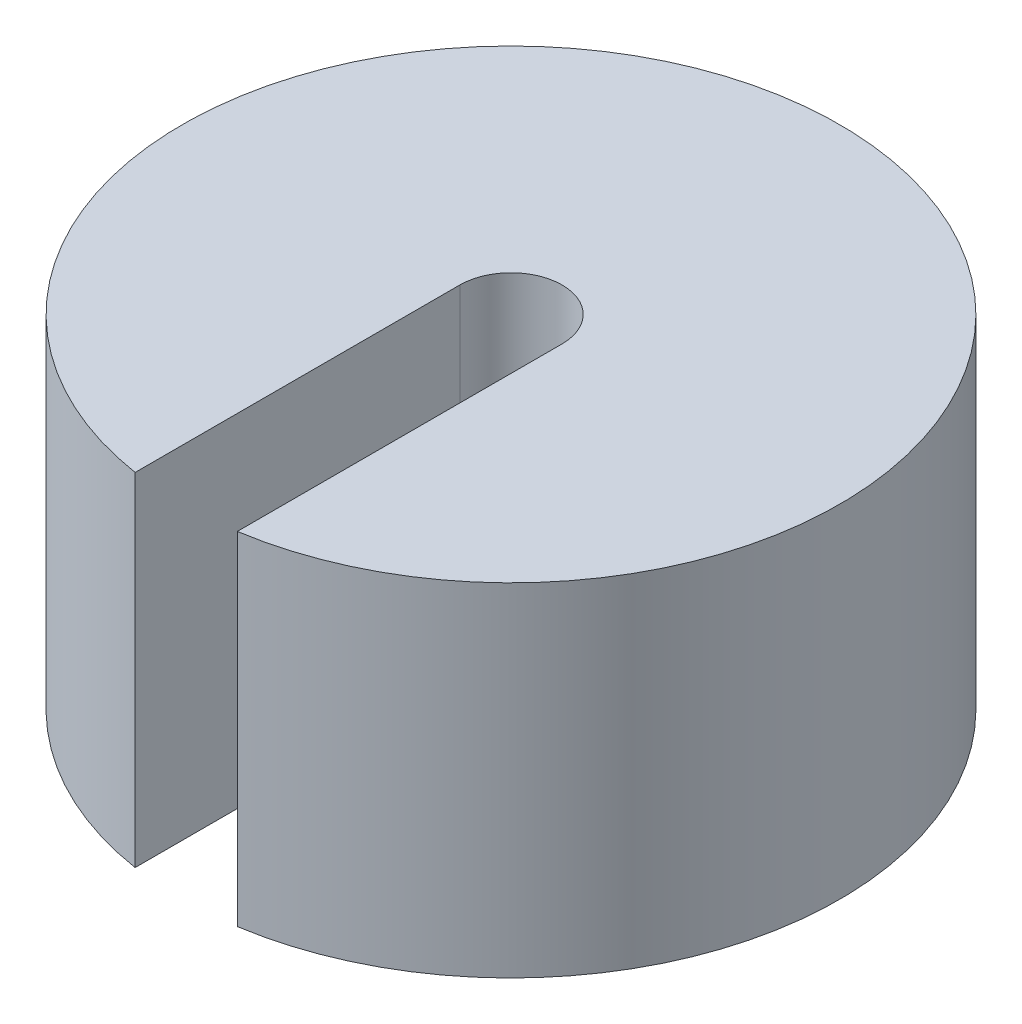
ISO-10303-21;
HEADER;
FILE_DESCRIPTION(('STEP AP214'),'2;1');
FILE_NAME('part.step','',(''),(''),'','','');
FILE_SCHEMA(('AUTOMOTIVE_DESIGN { 1 0 10303 214 1 1 1 1 }'));
ENDSEC;
DATA;
#1=APPLICATION_CONTEXT('core data for automotive mechanical design processes');
#2=APPLICATION_PROTOCOL_DEFINITION('international standard','automotive_design',2000,#1);
#3=PRODUCT_CONTEXT('',#1,'mechanical');
#4=PRODUCT('Part','Part','',(#3));
#5=PRODUCT_RELATED_PRODUCT_CATEGORY('part','',(#4));
#6=PRODUCT_DEFINITION_FORMATION('','',#4);
#7=PRODUCT_DEFINITION_CONTEXT('part definition',#1,'design');
#8=PRODUCT_DEFINITION('design','',#6,#7);
#9=PRODUCT_DEFINITION_SHAPE('','',#8);
#10=(LENGTH_UNIT() NAMED_UNIT(*) SI_UNIT(.MILLI.,.METRE.));
#11=(NAMED_UNIT(*) PLANE_ANGLE_UNIT() SI_UNIT($,.RADIAN.));
#12=(NAMED_UNIT(*) SI_UNIT($,.STERADIAN.) SOLID_ANGLE_UNIT());
#13=UNCERTAINTY_MEASURE_WITH_UNIT(LENGTH_MEASURE(1.E-05),#10,'distance_accuracy_value','');
#14=(GEOMETRIC_REPRESENTATION_CONTEXT(3) GLOBAL_UNCERTAINTY_ASSIGNED_CONTEXT((#13)) GLOBAL_UNIT_ASSIGNED_CONTEXT((#10,
#11,#12)) REPRESENTATION_CONTEXT('',''));
#15=CARTESIAN_POINT('',(0.,0.,0.));
#16=DIRECTION('',(0.,0.,1.));
#17=DIRECTION('',(1.,0.,0.));
#18=AXIS2_PLACEMENT_3D('',#15,#16,#17);
#19=CARTESIAN_POINT('',(0.,21.6,0.));
#20=DIRECTION('',(0.,-1.,0.));
#21=DIRECTION('',(0.,0.,-1.));
#22=AXIS2_PLACEMENT_3D('',#19,#20,#21);
#23=CYLINDRICAL_SURFACE('',#22,20.75);
#24=CARTESIAN_POINT('',(0.,21.6,0.));
#25=DIRECTION('',(0.,1.,0.));
#26=DIRECTION('',(0.,0.,1.));
#27=AXIS2_PLACEMENT_3D('',#24,#25,#26);
#28=CIRCLE('',#27,20.75);
#29=CARTESIAN_POINT('',(3.225,21.6,20.4978504970643));
#30=VERTEX_POINT('',#29);
#31=CARTESIAN_POINT('',(-3.225,21.6,20.4978504970643));
#32=VERTEX_POINT('',#31);
#33=EDGE_CURVE('E101',#30,#32,#28,.T.);
#34=ORIENTED_EDGE('',*,*,#33,.F.);
#35=DIRECTION('',(0.,-1.,0.));
#36=VECTOR('',#35,1.);
#37=CARTESIAN_POINT('',(3.225,21.6,20.4978504970643));
#38=LINE('',#37,#36);
#39=CARTESIAN_POINT('',(3.225,0.,20.4978504970643));
#40=VERTEX_POINT('',#39);
#41=EDGE_CURVE('E107',#30,#40,#38,.T.);
#42=ORIENTED_EDGE('',*,*,#41,.T.);
#43=CARTESIAN_POINT('',(0.,0.,0.));
#44=DIRECTION('',(0.,1.,0.));
#45=DIRECTION('',(0.,0.,1.));
#46=AXIS2_PLACEMENT_3D('',#43,#44,#45);
#47=CIRCLE('',#46,20.75);
#48=CARTESIAN_POINT('',(-3.225,0.,20.4978504970643));
#49=VERTEX_POINT('',#48);
#50=EDGE_CURVE('E109',#40,#49,#47,.T.);
#51=ORIENTED_EDGE('',*,*,#50,.T.);
#52=DIRECTION('',(0.,-1.,0.));
#53=VECTOR('',#52,1.);
#54=CARTESIAN_POINT('',(-3.225,21.6,20.4978504970643));
#55=LINE('',#54,#53);
#56=EDGE_CURVE('E57',#49,#32,#55,.F.);
#57=ORIENTED_EDGE('',*,*,#56,.T.);
#58=EDGE_LOOP('',(#34,#42,#51,#57));
#59=FACE_BOUND('',#58,.T.);
#60=ADVANCED_FACE('F43',(#59),#23,.T.);
#61=CARTESIAN_POINT('',(0.,21.6,0.));
#62=DIRECTION('',(0.,1.,0.));
#63=DIRECTION('',(0.,0.,1.));
#64=AXIS2_PLACEMENT_3D('',#61,#62,#63);
#65=PLANE('',#64);
#66=DIRECTION('',(0.,0.,-1.));
#67=VECTOR('',#66,1.);
#68=CARTESIAN_POINT('',(3.225,21.6,21.9099893869596));
#69=LINE('',#68,#67);
#70=CARTESIAN_POINT('',(3.225,21.6,0.));
#71=VERTEX_POINT('',#70);
#72=EDGE_CURVE('E89',#30,#71,#69,.T.);
#73=ORIENTED_EDGE('',*,*,#72,.F.);
#74=ORIENTED_EDGE('',*,*,#33,.T.);
#75=DIRECTION('',(0.,0.,1.));
#76=VECTOR('',#75,1.);
#77=CARTESIAN_POINT('',(-3.225,21.6,0.));
#78=LINE('',#77,#76);
#79=CARTESIAN_POINT('',(-3.225,21.6,0.));
#80=VERTEX_POINT('',#79);
#81=EDGE_CURVE('E84',#80,#32,#78,.T.);
#82=ORIENTED_EDGE('',*,*,#81,.F.);
#83=CARTESIAN_POINT('',(0.,21.6,0.));
#84=DIRECTION('',(0.,1.,0.));
#85=DIRECTION('',(0.,0.,1.));
#86=AXIS2_PLACEMENT_3D('',#83,#84,#85);
#87=CIRCLE('',#86,3.225);
#88=EDGE_CURVE('E92',#71,#80,#87,.T.);
#89=ORIENTED_EDGE('',*,*,#88,.F.);
#90=EDGE_LOOP('',(#73,#74,#82,#89));
#91=FACE_BOUND('',#90,.T.);
#92=ADVANCED_FACE('F99',(#91),#65,.T.);
#93=CARTESIAN_POINT('',(0.,0.,0.));
#94=DIRECTION('',(0.,1.,0.));
#95=DIRECTION('',(0.,0.,1.));
#96=AXIS2_PLACEMENT_3D('',#93,#94,#95);
#97=PLANE('',#96);
#98=ORIENTED_EDGE('',*,*,#50,.F.);
#99=DIRECTION('',(0.,0.,-1.));
#100=VECTOR('',#99,1.);
#101=CARTESIAN_POINT('',(3.225,0.,0.));
#102=LINE('',#101,#100);
#103=CARTESIAN_POINT('',(3.225,0.,0.));
#104=VERTEX_POINT('',#103);
#105=EDGE_CURVE('E11',#40,#104,#102,.T.);
#106=ORIENTED_EDGE('',*,*,#105,.T.);
#107=CARTESIAN_POINT('',(0.,0.,0.));
#108=DIRECTION('',(0.,1.,0.));
#109=DIRECTION('',(0.,0.,1.));
#110=AXIS2_PLACEMENT_3D('',#107,#108,#109);
#111=CIRCLE('',#110,3.225);
#112=CARTESIAN_POINT('',(-3.225,0.,0.));
#113=VERTEX_POINT('',#112);
#114=EDGE_CURVE('E50',#104,#113,#111,.T.);
#115=ORIENTED_EDGE('',*,*,#114,.T.);
#116=DIRECTION('',(0.,0.,1.));
#117=VECTOR('',#116,1.);
#118=CARTESIAN_POINT('',(-3.225,0.,0.));
#119=LINE('',#118,#117);
#120=EDGE_CURVE('E85',#113,#49,#119,.T.);
#121=ORIENTED_EDGE('',*,*,#120,.T.);
#122=EDGE_LOOP('',(#98,#106,#115,#121));
#123=FACE_BOUND('',#122,.T.);
#124=ADVANCED_FACE('F115',(#123),#97,.F.);
#125=CARTESIAN_POINT('',(0.,-39.,0.));
#126=DIRECTION('',(0.,1.,0.));
#127=DIRECTION('',(0.,0.,1.));
#128=AXIS2_PLACEMENT_3D('',#125,#126,#127);
#129=CYLINDRICAL_SURFACE('',#128,3.225);
#130=DIRECTION('',(0.,1.,0.));
#131=VECTOR('',#130,1.);
#132=CARTESIAN_POINT('',(3.225,-39.,0.));
#133=LINE('',#132,#131);
#134=EDGE_CURVE('E88',#104,#71,#133,.T.);
#135=ORIENTED_EDGE('',*,*,#134,.T.);
#136=ORIENTED_EDGE('',*,*,#88,.T.);
#137=DIRECTION('',(0.,1.,0.));
#138=VECTOR('',#137,1.);
#139=CARTESIAN_POINT('',(-3.225,-39.,0.));
#140=LINE('',#139,#138);
#141=EDGE_CURVE('E80',#113,#80,#140,.T.);
#142=ORIENTED_EDGE('',*,*,#141,.F.);
#143=ORIENTED_EDGE('',*,*,#114,.F.);
#144=EDGE_LOOP('',(#135,#136,#142,#143));
#145=FACE_BOUND('',#144,.T.);
#146=ADVANCED_FACE('F93',(#145),#129,.F.);
#147=CARTESIAN_POINT('',(3.225,-39.,21.9099893869596));
#148=DIRECTION('',(1.,0.,0.));
#149=DIRECTION('',(0.,0.,-1.));
#150=AXIS2_PLACEMENT_3D('',#147,#148,#149);
#151=PLANE('',#150);
#152=ORIENTED_EDGE('',*,*,#72,.T.);
#153=ORIENTED_EDGE('',*,*,#134,.F.);
#154=ORIENTED_EDGE('',*,*,#105,.F.);
#155=ORIENTED_EDGE('',*,*,#41,.F.);
#156=EDGE_LOOP('',(#152,#153,#154,#155));
#157=FACE_BOUND('',#156,.T.);
#158=ADVANCED_FACE('F116',(#157),#151,.F.);
#159=CARTESIAN_POINT('',(-3.225,-39.,0.));
#160=DIRECTION('',(-1.,0.,0.));
#161=DIRECTION('',(0.,0.,1.));
#162=AXIS2_PLACEMENT_3D('',#159,#160,#161);
#163=PLANE('',#162);
#164=ORIENTED_EDGE('',*,*,#120,.F.);
#165=ORIENTED_EDGE('',*,*,#141,.T.);
#166=ORIENTED_EDGE('',*,*,#81,.T.);
#167=ORIENTED_EDGE('',*,*,#56,.F.);
#168=EDGE_LOOP('',(#164,#165,#166,#167));
#169=FACE_BOUND('',#168,.T.);
#170=ADVANCED_FACE('F82',(#169),#163,.F.);
#171=CLOSED_SHELL('',(#60,#92,#124,#146,#158,#170));
#172=MANIFOLD_SOLID_BREP('B2',#171);
#173=ADVANCED_BREP_SHAPE_REPRESENTATION('',(#18,#172),#14);
#174=SHAPE_DEFINITION_REPRESENTATION(#9,#173);
ENDSEC;
END-ISO-10303-21;
